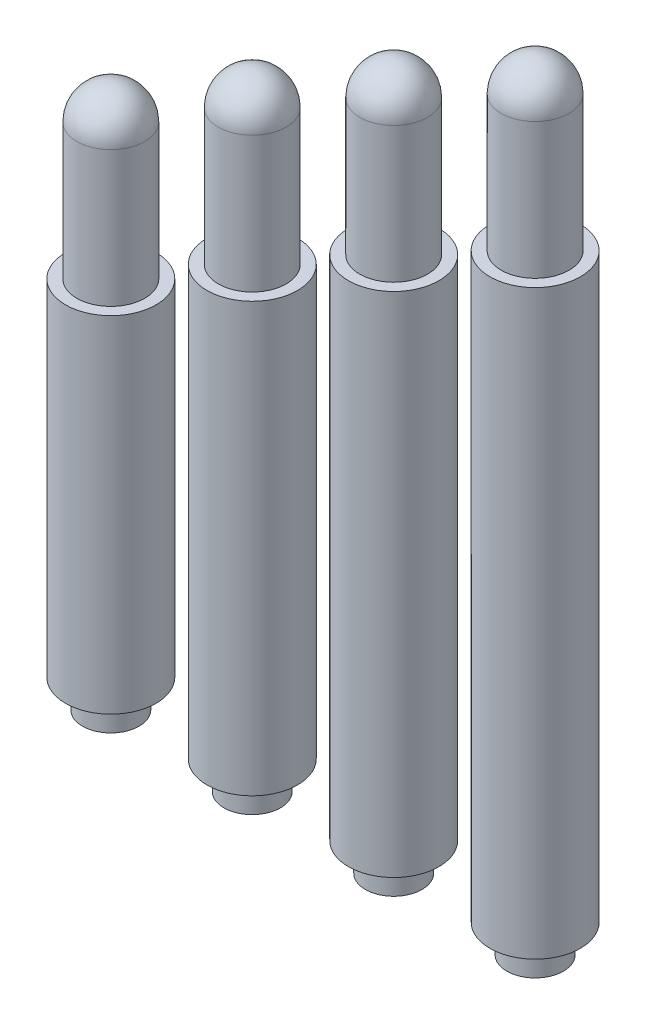
ISO-10303-21;
HEADER;
FILE_DESCRIPTION(('STEP AP214'),'2;1');
FILE_NAME('part.step','',(''),(''),'','','');
FILE_SCHEMA(('AUTOMOTIVE_DESIGN { 1 0 10303 214 1 1 1 1 }'));
ENDSEC;
DATA;
#1=APPLICATION_CONTEXT('core data for automotive mechanical design processes');
#2=APPLICATION_PROTOCOL_DEFINITION('international standard','automotive_design',2000,#1);
#3=PRODUCT_CONTEXT('',#1,'mechanical');
#4=PRODUCT('Part','Part','',(#3));
#5=PRODUCT_RELATED_PRODUCT_CATEGORY('part','',(#4));
#6=PRODUCT_DEFINITION_FORMATION('','',#4);
#7=PRODUCT_DEFINITION_CONTEXT('part definition',#1,'design');
#8=PRODUCT_DEFINITION('design','',#6,#7);
#9=PRODUCT_DEFINITION_SHAPE('','',#8);
#10=(LENGTH_UNIT() NAMED_UNIT(*) SI_UNIT(.MILLI.,.METRE.));
#11=(NAMED_UNIT(*) PLANE_ANGLE_UNIT() SI_UNIT($,.RADIAN.));
#12=(NAMED_UNIT(*) SI_UNIT($,.STERADIAN.) SOLID_ANGLE_UNIT());
#13=UNCERTAINTY_MEASURE_WITH_UNIT(LENGTH_MEASURE(1.E-05),#10,'distance_accuracy_value','');
#14=(GEOMETRIC_REPRESENTATION_CONTEXT(3) GLOBAL_UNCERTAINTY_ASSIGNED_CONTEXT((#13)) GLOBAL_UNIT_ASSIGNED_CONTEXT((#10,
#11,#12)) REPRESENTATION_CONTEXT('',''));
#15=CARTESIAN_POINT('',(0.,0.,0.));
#16=DIRECTION('',(0.,0.,1.));
#17=DIRECTION('',(1.,0.,0.));
#18=AXIS2_PLACEMENT_3D('',#15,#16,#17);
#19=CARTESIAN_POINT('',(7.5,0.,0.));
#20=DIRECTION('',(0.,-1.,0.));
#21=DIRECTION('',(1.,0.,0.));
#22=AXIS2_PLACEMENT_3D('',#19,#20,#21);
#23=PLANE('',#22);
#24=CARTESIAN_POINT('',(7.5,0.,0.));
#25=DIRECTION('',(0.,1.,0.));
#26=DIRECTION('',(-1.,0.,0.));
#27=AXIS2_PLACEMENT_3D('',#24,#25,#26);
#28=CIRCLE('',#27,0.5);
#29=CARTESIAN_POINT('',(7.,0.,0.));
#30=VERTEX_POINT('',#29);
#31=EDGE_CURVE('E53',#30,#30,#28,.T.);
#32=ORIENTED_EDGE('',*,*,#31,.F.);
#33=EDGE_LOOP('',(#32));
#34=FACE_BOUND('',#33,.T.);
#35=ADVANCED_FACE('F45',(#34),#23,.T.);
#36=CARTESIAN_POINT('',(7.5,13.78,0.));
#37=DIRECTION('',(0.,1.,0.));
#38=DIRECTION('',(-1.,0.,0.));
#39=AXIS2_PLACEMENT_3D('',#36,#37,#38);
#40=CYLINDRICAL_SURFACE('',#39,0.5);
#41=ORIENTED_EDGE('',*,*,#31,.T.);
#42=EDGE_LOOP('',(#41));
#43=FACE_BOUND('',#42,.T.);
#44=CARTESIAN_POINT('',(7.5,0.5,0.));
#45=DIRECTION('',(0.,1.,0.));
#46=DIRECTION('',(-1.,0.,0.));
#47=AXIS2_PLACEMENT_3D('',#44,#45,#46);
#48=CIRCLE('',#47,0.5);
#49=CARTESIAN_POINT('',(7.,0.5,0.));
#50=VERTEX_POINT('',#49);
#51=EDGE_CURVE('E58',#50,#50,#48,.T.);
#52=ORIENTED_EDGE('',*,*,#51,.F.);
#53=EDGE_LOOP('',(#52));
#54=FACE_BOUND('',#53,.T.);
#55=ADVANCED_FACE('F94',(#43,#54),#40,.T.);
#56=CARTESIAN_POINT('',(7.,0.5,0.));
#57=DIRECTION('',(0.,-1.,0.));
#58=DIRECTION('',(1.,0.,0.));
#59=AXIS2_PLACEMENT_3D('',#56,#57,#58);
#60=PLANE('',#59);
#61=ORIENTED_EDGE('',*,*,#51,.T.);
#62=EDGE_LOOP('',(#61));
#63=FACE_BOUND('',#62,.T.);
#64=CARTESIAN_POINT('',(7.5,0.5,0.));
#65=DIRECTION('',(0.,1.,0.));
#66=DIRECTION('',(-1.,0.,0.));
#67=AXIS2_PLACEMENT_3D('',#64,#65,#66);
#68=CIRCLE('',#67,0.8);
#69=CARTESIAN_POINT('',(6.7,0.5,0.));
#70=VERTEX_POINT('',#69);
#71=EDGE_CURVE('E63',#70,#70,#68,.T.);
#72=ORIENTED_EDGE('',*,*,#71,.F.);
#73=EDGE_LOOP('',(#72));
#74=FACE_BOUND('',#73,.T.);
#75=ADVANCED_FACE('F90',(#63,#74),#60,.T.);
#76=CARTESIAN_POINT('',(7.5,13.78,0.));
#77=DIRECTION('',(0.,1.,0.));
#78=DIRECTION('',(-1.,0.,0.));
#79=AXIS2_PLACEMENT_3D('',#76,#77,#78);
#80=CYLINDRICAL_SURFACE('',#79,0.799999999999999);
#81=ORIENTED_EDGE('',*,*,#71,.T.);
#82=EDGE_LOOP('',(#81));
#83=FACE_BOUND('',#82,.T.);
#84=CARTESIAN_POINT('',(7.5,10.78,0.));
#85=DIRECTION('',(0.,1.,0.));
#86=DIRECTION('',(-1.,0.,0.));
#87=AXIS2_PLACEMENT_3D('',#84,#85,#86);
#88=CIRCLE('',#87,0.799999999999999);
#89=CARTESIAN_POINT('',(6.7,10.78,0.));
#90=VERTEX_POINT('',#89);
#91=EDGE_CURVE('E69',#90,#90,#88,.T.);
#92=ORIENTED_EDGE('',*,*,#91,.F.);
#93=EDGE_LOOP('',(#92));
#94=FACE_BOUND('',#93,.T.);
#95=ADVANCED_FACE('F82',(#83,#94),#80,.T.);
#96=CARTESIAN_POINT('',(6.7,10.78,0.));
#97=DIRECTION('',(0.,1.,0.));
#98=DIRECTION('',(-1.,0.,0.));
#99=AXIS2_PLACEMENT_3D('',#96,#97,#98);
#100=PLANE('',#99);
#101=ORIENTED_EDGE('',*,*,#91,.T.);
#102=EDGE_LOOP('',(#101));
#103=FACE_BOUND('',#102,.T.);
#104=CARTESIAN_POINT('',(7.5,10.78,0.));
#105=DIRECTION('',(0.,1.,0.));
#106=DIRECTION('',(-1.,0.,0.));
#107=AXIS2_PLACEMENT_3D('',#104,#105,#106);
#108=CIRCLE('',#107,0.6);
#109=CARTESIAN_POINT('',(6.9,10.78,0.));
#110=VERTEX_POINT('',#109);
#111=EDGE_CURVE('E73',#110,#110,#108,.T.);
#112=ORIENTED_EDGE('',*,*,#111,.F.);
#113=EDGE_LOOP('',(#112));
#114=FACE_BOUND('',#113,.T.);
#115=ADVANCED_FACE('F80',(#103,#114),#100,.T.);
#116=CARTESIAN_POINT('',(7.5,13.78,0.));
#117=DIRECTION('',(0.,1.,0.));
#118=DIRECTION('',(-1.,0.,0.));
#119=AXIS2_PLACEMENT_3D('',#116,#117,#118);
#120=CYLINDRICAL_SURFACE('',#119,0.6);
#121=CARTESIAN_POINT('',(7.5,13.18,0.));
#122=DIRECTION('',(0.,1.,0.));
#123=DIRECTION('',(-1.,0.,0.));
#124=AXIS2_PLACEMENT_3D('',#121,#122,#123);
#125=CIRCLE('',#124,0.6);
#126=CARTESIAN_POINT('',(6.9,13.18,0.));
#127=VERTEX_POINT('',#126);
#128=EDGE_CURVE('E11',#127,#127,#125,.F.);
#129=ORIENTED_EDGE('',*,*,#128,.T.);
#130=EDGE_LOOP('',(#129));
#131=FACE_BOUND('',#130,.T.);
#132=ORIENTED_EDGE('',*,*,#111,.T.);
#133=EDGE_LOOP('',(#132));
#134=FACE_BOUND('',#133,.T.);
#135=ADVANCED_FACE('F78',(#131,#134),#120,.T.);
#136=CARTESIAN_POINT('',(7.5,13.18,0.));
#137=DIRECTION('',(0.,1.,0.));
#138=DIRECTION('',(-1.,0.,0.));
#139=AXIS2_PLACEMENT_3D('',#136,#137,#138);
#140=SPHERICAL_SURFACE('',#139,0.6);
#141=ORIENTED_EDGE('',*,*,#128,.F.);
#142=EDGE_LOOP('',(#141));
#143=FACE_BOUND('',#142,.T.);
#144=ADVANCED_FACE('F47',(#143),#140,.T.);
#145=CLOSED_SHELL('',(#35,#55,#75,#95,#115,#135,#144));
#146=MANIFOLD_SOLID_BREP('B2',#145);
#147=CARTESIAN_POINT('',(5.,0.,0.));
#148=DIRECTION('',(0.,-1.,0.));
#149=DIRECTION('',(1.,0.,0.));
#150=AXIS2_PLACEMENT_3D('',#147,#148,#149);
#151=PLANE('',#150);
#152=CARTESIAN_POINT('',(5.,0.,0.));
#153=DIRECTION('',(0.,1.,0.));
#154=DIRECTION('',(-1.,0.,0.));
#155=AXIS2_PLACEMENT_3D('',#152,#153,#154);
#156=CIRCLE('',#155,0.5);
#157=CARTESIAN_POINT('',(4.5,0.,0.));
#158=VERTEX_POINT('',#157);
#159=EDGE_CURVE('E166',#158,#158,#156,.T.);
#160=ORIENTED_EDGE('',*,*,#159,.F.);
#161=EDGE_LOOP('',(#160));
#162=FACE_BOUND('',#161,.T.);
#163=ADVANCED_FACE('F159',(#162),#151,.T.);
#164=CARTESIAN_POINT('',(5.,12.47,0.));
#165=DIRECTION('',(0.,1.,0.));
#166=DIRECTION('',(-1.,0.,0.));
#167=AXIS2_PLACEMENT_3D('',#164,#165,#166);
#168=CYLINDRICAL_SURFACE('',#167,0.5);
#169=ORIENTED_EDGE('',*,*,#159,.T.);
#170=EDGE_LOOP('',(#169));
#171=FACE_BOUND('',#170,.T.);
#172=CARTESIAN_POINT('',(5.,0.5,0.));
#173=DIRECTION('',(0.,1.,0.));
#174=DIRECTION('',(-1.,0.,0.));
#175=AXIS2_PLACEMENT_3D('',#172,#173,#174);
#176=CIRCLE('',#175,0.499999999999999);
#177=CARTESIAN_POINT('',(4.5,0.5,0.));
#178=VERTEX_POINT('',#177);
#179=EDGE_CURVE('E170',#178,#178,#176,.T.);
#180=ORIENTED_EDGE('',*,*,#179,.F.);
#181=EDGE_LOOP('',(#180));
#182=FACE_BOUND('',#181,.T.);
#183=ADVANCED_FACE('F202',(#171,#182),#168,.T.);
#184=CARTESIAN_POINT('',(4.5,0.5,0.));
#185=DIRECTION('',(0.,-1.,0.));
#186=DIRECTION('',(1.,0.,0.));
#187=AXIS2_PLACEMENT_3D('',#184,#185,#186);
#188=PLANE('',#187);
#189=ORIENTED_EDGE('',*,*,#179,.T.);
#190=EDGE_LOOP('',(#189));
#191=FACE_BOUND('',#190,.T.);
#192=CARTESIAN_POINT('',(5.,0.5,0.));
#193=DIRECTION('',(0.,1.,0.));
#194=DIRECTION('',(-1.,0.,0.));
#195=AXIS2_PLACEMENT_3D('',#192,#193,#194);
#196=CIRCLE('',#195,0.8);
#197=CARTESIAN_POINT('',(4.2,0.5,0.));
#198=VERTEX_POINT('',#197);
#199=EDGE_CURVE('E174',#198,#198,#196,.T.);
#200=ORIENTED_EDGE('',*,*,#199,.F.);
#201=EDGE_LOOP('',(#200));
#202=FACE_BOUND('',#201,.T.);
#203=ADVANCED_FACE('F198',(#191,#202),#188,.T.);
#204=CARTESIAN_POINT('',(5.,12.47,0.));
#205=DIRECTION('',(0.,1.,0.));
#206=DIRECTION('',(-1.,0.,0.));
#207=AXIS2_PLACEMENT_3D('',#204,#205,#206);
#208=CYLINDRICAL_SURFACE('',#207,0.799999999999999);
#209=ORIENTED_EDGE('',*,*,#199,.T.);
#210=EDGE_LOOP('',(#209));
#211=FACE_BOUND('',#210,.T.);
#212=CARTESIAN_POINT('',(5.,9.47,0.));
#213=DIRECTION('',(0.,1.,0.));
#214=DIRECTION('',(-1.,0.,0.));
#215=AXIS2_PLACEMENT_3D('',#212,#213,#214);
#216=CIRCLE('',#215,0.799999999999999);
#217=CARTESIAN_POINT('',(4.2,9.47,0.));
#218=VERTEX_POINT('',#217);
#219=EDGE_CURVE('E179',#218,#218,#216,.T.);
#220=ORIENTED_EDGE('',*,*,#219,.F.);
#221=EDGE_LOOP('',(#220));
#222=FACE_BOUND('',#221,.T.);
#223=ADVANCED_FACE('F190',(#211,#222),#208,.T.);
#224=CARTESIAN_POINT('',(4.2,9.47,0.));
#225=DIRECTION('',(0.,1.,0.));
#226=DIRECTION('',(-1.,0.,0.));
#227=AXIS2_PLACEMENT_3D('',#224,#225,#226);
#228=PLANE('',#227);
#229=ORIENTED_EDGE('',*,*,#219,.T.);
#230=EDGE_LOOP('',(#229));
#231=FACE_BOUND('',#230,.T.);
#232=CARTESIAN_POINT('',(5.,9.47,0.));
#233=DIRECTION('',(0.,1.,0.));
#234=DIRECTION('',(-1.,0.,0.));
#235=AXIS2_PLACEMENT_3D('',#232,#233,#234);
#236=CIRCLE('',#235,0.6);
#237=CARTESIAN_POINT('',(4.4,9.47,0.));
#238=VERTEX_POINT('',#237);
#239=EDGE_CURVE('E182',#238,#238,#236,.T.);
#240=ORIENTED_EDGE('',*,*,#239,.F.);
#241=EDGE_LOOP('',(#240));
#242=FACE_BOUND('',#241,.T.);
#243=ADVANCED_FACE('F188',(#231,#242),#228,.T.);
#244=CARTESIAN_POINT('',(5.,12.47,0.));
#245=DIRECTION('',(0.,1.,0.));
#246=DIRECTION('',(-1.,0.,0.));
#247=AXIS2_PLACEMENT_3D('',#244,#245,#246);
#248=CYLINDRICAL_SURFACE('',#247,0.6);
#249=CARTESIAN_POINT('',(5.,11.87,0.));
#250=DIRECTION('',(0.,1.,0.));
#251=DIRECTION('',(-1.,0.,0.));
#252=AXIS2_PLACEMENT_3D('',#249,#250,#251);
#253=CIRCLE('',#252,0.6);
#254=CARTESIAN_POINT('',(4.4,11.87,0.));
#255=VERTEX_POINT('',#254);
#256=EDGE_CURVE('E44',#255,#255,#253,.F.);
#257=ORIENTED_EDGE('',*,*,#256,.T.);
#258=EDGE_LOOP('',(#257));
#259=FACE_BOUND('',#258,.T.);
#260=ORIENTED_EDGE('',*,*,#239,.T.);
#261=EDGE_LOOP('',(#260));
#262=FACE_BOUND('',#261,.T.);
#263=ADVANCED_FACE('F186',(#259,#262),#248,.T.);
#264=CARTESIAN_POINT('',(5.,11.87,0.));
#265=DIRECTION('',(0.,1.,0.));
#266=DIRECTION('',(-1.,0.,0.));
#267=AXIS2_PLACEMENT_3D('',#264,#265,#266);
#268=SPHERICAL_SURFACE('',#267,0.6);
#269=ORIENTED_EDGE('',*,*,#256,.F.);
#270=EDGE_LOOP('',(#269));
#271=FACE_BOUND('',#270,.T.);
#272=ADVANCED_FACE('F161',(#271),#268,.T.);
#273=CLOSED_SHELL('',(#163,#183,#203,#223,#243,#263,#272));
#274=MANIFOLD_SOLID_BREP('B6',#273);
#275=CARTESIAN_POINT('',(2.5,0.,0.));
#276=DIRECTION('',(0.,-1.,0.));
#277=DIRECTION('',(1.,0.,0.));
#278=AXIS2_PLACEMENT_3D('',#275,#276,#277);
#279=PLANE('',#278);
#280=CARTESIAN_POINT('',(2.5,0.,0.));
#281=DIRECTION('',(0.,1.,0.));
#282=DIRECTION('',(-1.,0.,0.));
#283=AXIS2_PLACEMENT_3D('',#280,#281,#282);
#284=CIRCLE('',#283,0.5);
#285=CARTESIAN_POINT('',(2.,0.,0.));
#286=VERTEX_POINT('',#285);
#287=EDGE_CURVE('E273',#286,#286,#284,.T.);
#288=ORIENTED_EDGE('',*,*,#287,.F.);
#289=EDGE_LOOP('',(#288));
#290=FACE_BOUND('',#289,.T.);
#291=ADVANCED_FACE('F266',(#290),#279,.T.);
#292=CARTESIAN_POINT('',(2.5,11.07,0.));
#293=DIRECTION('',(0.,1.,0.));
#294=DIRECTION('',(-1.,0.,0.));
#295=AXIS2_PLACEMENT_3D('',#292,#293,#294);
#296=CYLINDRICAL_SURFACE('',#295,0.5);
#297=ORIENTED_EDGE('',*,*,#287,.T.);
#298=EDGE_LOOP('',(#297));
#299=FACE_BOUND('',#298,.T.);
#300=CARTESIAN_POINT('',(2.5,0.5,0.));
#301=DIRECTION('',(0.,1.,0.));
#302=DIRECTION('',(-1.,0.,0.));
#303=AXIS2_PLACEMENT_3D('',#300,#301,#302);
#304=CIRCLE('',#303,0.5);
#305=CARTESIAN_POINT('',(2.,0.5,0.));
#306=VERTEX_POINT('',#305);
#307=EDGE_CURVE('E277',#306,#306,#304,.T.);
#308=ORIENTED_EDGE('',*,*,#307,.F.);
#309=EDGE_LOOP('',(#308));
#310=FACE_BOUND('',#309,.T.);
#311=ADVANCED_FACE('F309',(#299,#310),#296,.T.);
#312=CARTESIAN_POINT('',(2.,0.5,0.));
#313=DIRECTION('',(0.,-1.,0.));
#314=DIRECTION('',(1.,0.,0.));
#315=AXIS2_PLACEMENT_3D('',#312,#313,#314);
#316=PLANE('',#315);
#317=ORIENTED_EDGE('',*,*,#307,.T.);
#318=EDGE_LOOP('',(#317));
#319=FACE_BOUND('',#318,.T.);
#320=CARTESIAN_POINT('',(2.5,0.5,0.));
#321=DIRECTION('',(0.,1.,0.));
#322=DIRECTION('',(-1.,0.,0.));
#323=AXIS2_PLACEMENT_3D('',#320,#321,#322);
#324=CIRCLE('',#323,0.8);
#325=CARTESIAN_POINT('',(1.7,0.5,0.));
#326=VERTEX_POINT('',#325);
#327=EDGE_CURVE('E281',#326,#326,#324,.T.);
#328=ORIENTED_EDGE('',*,*,#327,.F.);
#329=EDGE_LOOP('',(#328));
#330=FACE_BOUND('',#329,.T.);
#331=ADVANCED_FACE('F305',(#319,#330),#316,.T.);
#332=CARTESIAN_POINT('',(2.5,11.07,0.));
#333=DIRECTION('',(0.,1.,0.));
#334=DIRECTION('',(-1.,0.,0.));
#335=AXIS2_PLACEMENT_3D('',#332,#333,#334);
#336=CYLINDRICAL_SURFACE('',#335,0.799999999999999);
#337=ORIENTED_EDGE('',*,*,#327,.T.);
#338=EDGE_LOOP('',(#337));
#339=FACE_BOUND('',#338,.T.);
#340=CARTESIAN_POINT('',(2.5,8.07,0.));
#341=DIRECTION('',(0.,1.,0.));
#342=DIRECTION('',(-1.,0.,0.));
#343=AXIS2_PLACEMENT_3D('',#340,#341,#342);
#344=CIRCLE('',#343,0.799999999999999);
#345=CARTESIAN_POINT('',(1.7,8.07,0.));
#346=VERTEX_POINT('',#345);
#347=EDGE_CURVE('E286',#346,#346,#344,.T.);
#348=ORIENTED_EDGE('',*,*,#347,.F.);
#349=EDGE_LOOP('',(#348));
#350=FACE_BOUND('',#349,.T.);
#351=ADVANCED_FACE('F297',(#339,#350),#336,.T.);
#352=CARTESIAN_POINT('',(1.7,8.07,0.));
#353=DIRECTION('',(0.,1.,0.));
#354=DIRECTION('',(-1.,0.,0.));
#355=AXIS2_PLACEMENT_3D('',#352,#353,#354);
#356=PLANE('',#355);
#357=ORIENTED_EDGE('',*,*,#347,.T.);
#358=EDGE_LOOP('',(#357));
#359=FACE_BOUND('',#358,.T.);
#360=CARTESIAN_POINT('',(2.5,8.07,0.));
#361=DIRECTION('',(0.,1.,0.));
#362=DIRECTION('',(-1.,0.,0.));
#363=AXIS2_PLACEMENT_3D('',#360,#361,#362);
#364=CIRCLE('',#363,0.6);
#365=CARTESIAN_POINT('',(1.9,8.07,0.));
#366=VERTEX_POINT('',#365);
#367=EDGE_CURVE('E289',#366,#366,#364,.T.);
#368=ORIENTED_EDGE('',*,*,#367,.F.);
#369=EDGE_LOOP('',(#368));
#370=FACE_BOUND('',#369,.T.);
#371=ADVANCED_FACE('F295',(#359,#370),#356,.T.);
#372=CARTESIAN_POINT('',(2.5,11.07,0.));
#373=DIRECTION('',(0.,1.,0.));
#374=DIRECTION('',(-1.,0.,0.));
#375=AXIS2_PLACEMENT_3D('',#372,#373,#374);
#376=CYLINDRICAL_SURFACE('',#375,0.6);
#377=CARTESIAN_POINT('',(2.5,10.47,0.));
#378=DIRECTION('',(0.,1.,0.));
#379=DIRECTION('',(-1.,0.,0.));
#380=AXIS2_PLACEMENT_3D('',#377,#378,#379);
#381=CIRCLE('',#380,0.6);
#382=CARTESIAN_POINT('',(1.9,10.47,0.));
#383=VERTEX_POINT('',#382);
#384=EDGE_CURVE('E158',#383,#383,#381,.F.);
#385=ORIENTED_EDGE('',*,*,#384,.T.);
#386=EDGE_LOOP('',(#385));
#387=FACE_BOUND('',#386,.T.);
#388=ORIENTED_EDGE('',*,*,#367,.T.);
#389=EDGE_LOOP('',(#388));
#390=FACE_BOUND('',#389,.T.);
#391=ADVANCED_FACE('F293',(#387,#390),#376,.T.);
#392=CARTESIAN_POINT('',(2.5,10.47,0.));
#393=DIRECTION('',(0.,1.,0.));
#394=DIRECTION('',(-1.,0.,0.));
#395=AXIS2_PLACEMENT_3D('',#392,#393,#394);
#396=SPHERICAL_SURFACE('',#395,0.6);
#397=ORIENTED_EDGE('',*,*,#384,.F.);
#398=EDGE_LOOP('',(#397));
#399=FACE_BOUND('',#398,.T.);
#400=ADVANCED_FACE('F268',(#399),#396,.T.);
#401=CLOSED_SHELL('',(#291,#311,#331,#351,#371,#391,#400));
#402=MANIFOLD_SOLID_BREP('B39',#401);
#403=CARTESIAN_POINT('',(0.,0.,0.));
#404=DIRECTION('',(0.,-1.,0.));
#405=DIRECTION('',(0.,0.,-1.));
#406=AXIS2_PLACEMENT_3D('',#403,#404,#405);
#407=PLANE('',#406);
#408=CARTESIAN_POINT('',(0.,0.,0.));
#409=DIRECTION('',(0.,1.,0.));
#410=DIRECTION('',(0.,0.,1.));
#411=AXIS2_PLACEMENT_3D('',#408,#409,#410);
#412=CIRCLE('',#411,0.499999999999999);
#413=CARTESIAN_POINT('',(0.,0.,0.499999999999999));
#414=VERTEX_POINT('',#413);
#415=EDGE_CURVE('E373',#414,#414,#412,.T.);
#416=ORIENTED_EDGE('',*,*,#415,.F.);
#417=EDGE_LOOP('',(#416));
#418=FACE_BOUND('',#417,.T.);
#419=ADVANCED_FACE('F366',(#418),#407,.T.);
#420=CARTESIAN_POINT('',(0.,9.6,0.));
#421=DIRECTION('',(0.,1.,0.));
#422=DIRECTION('',(0.,0.,1.));
#423=AXIS2_PLACEMENT_3D('',#420,#421,#422);
#424=CYLINDRICAL_SURFACE('',#423,0.499999999999999);
#425=ORIENTED_EDGE('',*,*,#415,.T.);
#426=EDGE_LOOP('',(#425));
#427=FACE_BOUND('',#426,.T.);
#428=CARTESIAN_POINT('',(0.,0.5,0.));
#429=DIRECTION('',(0.,1.,0.));
#430=DIRECTION('',(0.,0.,1.));
#431=AXIS2_PLACEMENT_3D('',#428,#429,#430);
#432=CIRCLE('',#431,0.499999999999999);
#433=CARTESIAN_POINT('',(0.,0.5,0.499999999999999));
#434=VERTEX_POINT('',#433);
#435=EDGE_CURVE('E377',#434,#434,#432,.T.);
#436=ORIENTED_EDGE('',*,*,#435,.F.);
#437=EDGE_LOOP('',(#436));
#438=FACE_BOUND('',#437,.T.);
#439=ADVANCED_FACE('F409',(#427,#438),#424,.T.);
#440=CARTESIAN_POINT('',(-0.499999999999999,0.5,0.));
#441=DIRECTION('',(0.,-1.,0.));
#442=DIRECTION('',(0.,0.,-1.));
#443=AXIS2_PLACEMENT_3D('',#440,#441,#442);
#444=PLANE('',#443);
#445=ORIENTED_EDGE('',*,*,#435,.T.);
#446=EDGE_LOOP('',(#445));
#447=FACE_BOUND('',#446,.T.);
#448=CARTESIAN_POINT('',(0.,0.5,0.));
#449=DIRECTION('',(0.,1.,0.));
#450=DIRECTION('',(0.,0.,1.));
#451=AXIS2_PLACEMENT_3D('',#448,#449,#450);
#452=CIRCLE('',#451,0.799999999999999);
#453=CARTESIAN_POINT('',(0.,0.5,0.799999999999999));
#454=VERTEX_POINT('',#453);
#455=EDGE_CURVE('E381',#454,#454,#452,.T.);
#456=ORIENTED_EDGE('',*,*,#455,.F.);
#457=EDGE_LOOP('',(#456));
#458=FACE_BOUND('',#457,.T.);
#459=ADVANCED_FACE('F405',(#447,#458),#444,.T.);
#460=CARTESIAN_POINT('',(0.,9.6,0.));
#461=DIRECTION('',(0.,1.,0.));
#462=DIRECTION('',(0.,0.,1.));
#463=AXIS2_PLACEMENT_3D('',#460,#461,#462);
#464=CYLINDRICAL_SURFACE('',#463,0.799999999999999);
#465=ORIENTED_EDGE('',*,*,#455,.T.);
#466=EDGE_LOOP('',(#465));
#467=FACE_BOUND('',#466,.T.);
#468=CARTESIAN_POINT('',(0.,6.6,0.));
#469=DIRECTION('',(0.,1.,0.));
#470=DIRECTION('',(0.,0.,1.));
#471=AXIS2_PLACEMENT_3D('',#468,#469,#470);
#472=CIRCLE('',#471,0.799999999999999);
#473=CARTESIAN_POINT('',(0.,6.6,0.799999999999999));
#474=VERTEX_POINT('',#473);
#475=EDGE_CURVE('E386',#474,#474,#472,.T.);
#476=ORIENTED_EDGE('',*,*,#475,.F.);
#477=EDGE_LOOP('',(#476));
#478=FACE_BOUND('',#477,.T.);
#479=ADVANCED_FACE('F397',(#467,#478),#464,.T.);
#480=CARTESIAN_POINT('',(-0.799999999999999,6.6,0.));
#481=DIRECTION('',(0.,1.,0.));
#482=DIRECTION('',(0.,0.,1.));
#483=AXIS2_PLACEMENT_3D('',#480,#481,#482);
#484=PLANE('',#483);
#485=ORIENTED_EDGE('',*,*,#475,.T.);
#486=EDGE_LOOP('',(#485));
#487=FACE_BOUND('',#486,.T.);
#488=CARTESIAN_POINT('',(0.,6.6,0.));
#489=DIRECTION('',(0.,1.,0.));
#490=DIRECTION('',(0.,0.,1.));
#491=AXIS2_PLACEMENT_3D('',#488,#489,#490);
#492=CIRCLE('',#491,0.6);
#493=CARTESIAN_POINT('',(0.,6.6,0.6));
#494=VERTEX_POINT('',#493);
#495=EDGE_CURVE('E389',#494,#494,#492,.T.);
#496=ORIENTED_EDGE('',*,*,#495,.F.);
#497=EDGE_LOOP('',(#496));
#498=FACE_BOUND('',#497,.T.);
#499=ADVANCED_FACE('F395',(#487,#498),#484,.T.);
#500=CARTESIAN_POINT('',(0.,9.6,0.));
#501=DIRECTION('',(0.,1.,0.));
#502=DIRECTION('',(0.,0.,1.));
#503=AXIS2_PLACEMENT_3D('',#500,#501,#502);
#504=CYLINDRICAL_SURFACE('',#503,0.6);
#505=CARTESIAN_POINT('',(0.,9.,0.));
#506=DIRECTION('',(0.,1.,0.));
#507=DIRECTION('',(0.,0.,1.));
#508=AXIS2_PLACEMENT_3D('',#505,#506,#507);
#509=CIRCLE('',#508,0.6);
#510=CARTESIAN_POINT('',(0.,9.,0.6));
#511=VERTEX_POINT('',#510);
#512=EDGE_CURVE('E265',#511,#511,#509,.F.);
#513=ORIENTED_EDGE('',*,*,#512,.T.);
#514=EDGE_LOOP('',(#513));
#515=FACE_BOUND('',#514,.T.);
#516=ORIENTED_EDGE('',*,*,#495,.T.);
#517=EDGE_LOOP('',(#516));
#518=FACE_BOUND('',#517,.T.);
#519=ADVANCED_FACE('F393',(#515,#518),#504,.T.);
#520=CARTESIAN_POINT('',(0.,9.,0.));
#521=DIRECTION('',(0.,1.,0.));
#522=DIRECTION('',(0.,0.,1.));
#523=AXIS2_PLACEMENT_3D('',#520,#521,#522);
#524=SPHERICAL_SURFACE('',#523,0.6);
#525=ORIENTED_EDGE('',*,*,#512,.F.);
#526=EDGE_LOOP('',(#525));
#527=FACE_BOUND('',#526,.T.);
#528=ADVANCED_FACE('F368',(#527),#524,.T.);
#529=CLOSED_SHELL('',(#419,#439,#459,#479,#499,#519,#528));
#530=MANIFOLD_SOLID_BREP('B153',#529);
#531=ADVANCED_BREP_SHAPE_REPRESENTATION('',(#18,#146,#274,#402,#530),#14);
#532=SHAPE_DEFINITION_REPRESENTATION(#9,#531);
ENDSEC;
END-ISO-10303-21;
